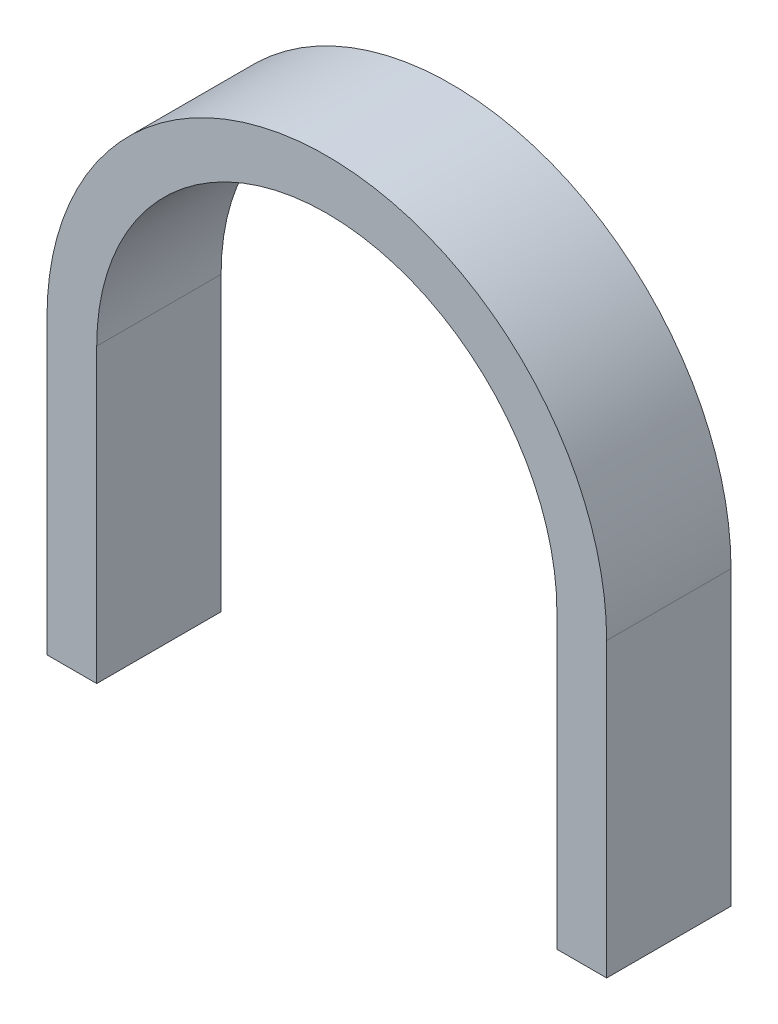
ISO-10303-21;
HEADER;
FILE_DESCRIPTION(('STEP AP214'),'2;1');
FILE_NAME('part.step','',(''),(''),'','','');
FILE_SCHEMA(('AUTOMOTIVE_DESIGN { 1 0 10303 214 1 1 1 1 }'));
ENDSEC;
DATA;
#1=APPLICATION_CONTEXT('core data for automotive mechanical design processes');
#2=APPLICATION_PROTOCOL_DEFINITION('international standard','automotive_design',2000,#1);
#3=PRODUCT_CONTEXT('',#1,'mechanical');
#4=PRODUCT('Part','Part','',(#3));
#5=PRODUCT_RELATED_PRODUCT_CATEGORY('part','',(#4));
#6=PRODUCT_DEFINITION_FORMATION('','',#4);
#7=PRODUCT_DEFINITION_CONTEXT('part definition',#1,'design');
#8=PRODUCT_DEFINITION('design','',#6,#7);
#9=PRODUCT_DEFINITION_SHAPE('','',#8);
#10=(LENGTH_UNIT() NAMED_UNIT(*) SI_UNIT(.MILLI.,.METRE.));
#11=(NAMED_UNIT(*) PLANE_ANGLE_UNIT() SI_UNIT($,.RADIAN.));
#12=(NAMED_UNIT(*) SI_UNIT($,.STERADIAN.) SOLID_ANGLE_UNIT());
#13=UNCERTAINTY_MEASURE_WITH_UNIT(LENGTH_MEASURE(1.E-05),#10,'distance_accuracy_value','');
#14=(GEOMETRIC_REPRESENTATION_CONTEXT(3) GLOBAL_UNCERTAINTY_ASSIGNED_CONTEXT((#13)) GLOBAL_UNIT_ASSIGNED_CONTEXT((#10,
#11,#12)) REPRESENTATION_CONTEXT('',''));
#15=CARTESIAN_POINT('',(0.,0.,0.));
#16=DIRECTION('',(0.,0.,1.));
#17=DIRECTION('',(1.,0.,0.));
#18=AXIS2_PLACEMENT_3D('',#15,#16,#17);
#19=CARTESIAN_POINT('',(0.,18.5,10.));
#20=DIRECTION('',(0.,0.,-1.));
#21=DIRECTION('',(-1.,0.,0.));
#22=AXIS2_PLACEMENT_3D('',#19,#20,#21);
#23=CYLINDRICAL_SURFACE('',#22,22.5);
#24=CARTESIAN_POINT('',(0.,18.5,0.));
#25=DIRECTION('',(0.,0.,1.));
#26=DIRECTION('',(1.,0.,0.));
#27=AXIS2_PLACEMENT_3D('',#24,#25,#26);
#28=CIRCLE('',#27,22.5);
#29=CARTESIAN_POINT('',(22.5,18.5,0.));
#30=VERTEX_POINT('',#29);
#31=CARTESIAN_POINT('',(-22.5,18.5,0.));
#32=VERTEX_POINT('',#31);
#33=EDGE_CURVE('E114',#30,#32,#28,.T.);
#34=ORIENTED_EDGE('',*,*,#33,.T.);
#35=DIRECTION('',(0.,0.,-1.));
#36=VECTOR('',#35,1.);
#37=CARTESIAN_POINT('',(-22.5,18.5,10.));
#38=LINE('',#37,#36);
#39=CARTESIAN_POINT('',(-22.5,18.5,10.));
#40=VERTEX_POINT('',#39);
#41=EDGE_CURVE('E11',#40,#32,#38,.T.);
#42=ORIENTED_EDGE('',*,*,#41,.F.);
#43=CARTESIAN_POINT('',(0.,18.5,10.));
#44=DIRECTION('',(0.,0.,1.));
#45=DIRECTION('',(1.,0.,0.));
#46=AXIS2_PLACEMENT_3D('',#43,#44,#45);
#47=CIRCLE('',#46,22.5);
#48=CARTESIAN_POINT('',(22.5,18.5,10.));
#49=VERTEX_POINT('',#48);
#50=EDGE_CURVE('E144',#49,#40,#47,.T.);
#51=ORIENTED_EDGE('',*,*,#50,.F.);
#52=DIRECTION('',(0.,0.,-1.));
#53=VECTOR('',#52,1.);
#54=CARTESIAN_POINT('',(22.5,18.5,10.));
#55=LINE('',#54,#53);
#56=EDGE_CURVE('E154',#49,#30,#55,.T.);
#57=ORIENTED_EDGE('',*,*,#56,.T.);
#58=EDGE_LOOP('',(#34,#42,#51,#57));
#59=FACE_BOUND('',#58,.T.);
#60=ADVANCED_FACE('F33',(#59),#23,.T.);
#61=CARTESIAN_POINT('',(-22.5,18.5,10.));
#62=DIRECTION('',(1.,0.,0.));
#63=DIRECTION('',(0.,0.,-1.));
#64=AXIS2_PLACEMENT_3D('',#61,#62,#63);
#65=PLANE('',#64);
#66=DIRECTION('',(0.,-1.,0.));
#67=VECTOR('',#66,1.);
#68=CARTESIAN_POINT('',(-22.5,18.5,0.));
#69=LINE('',#68,#67);
#70=CARTESIAN_POINT('',(-22.5,-5.,0.));
#71=VERTEX_POINT('',#70);
#72=EDGE_CURVE('E104',#32,#71,#69,.T.);
#73=ORIENTED_EDGE('',*,*,#72,.T.);
#74=DIRECTION('',(0.,0.,-1.));
#75=VECTOR('',#74,1.);
#76=CARTESIAN_POINT('',(-22.5,-5.,10.));
#77=LINE('',#76,#75);
#78=CARTESIAN_POINT('',(-22.5,-5.,10.));
#79=VERTEX_POINT('',#78);
#80=EDGE_CURVE('E108',#79,#71,#77,.T.);
#81=ORIENTED_EDGE('',*,*,#80,.F.);
#82=DIRECTION('',(0.,-1.,0.));
#83=VECTOR('',#82,1.);
#84=CARTESIAN_POINT('',(-22.5,18.5,10.));
#85=LINE('',#84,#83);
#86=EDGE_CURVE('E82',#40,#79,#85,.T.);
#87=ORIENTED_EDGE('',*,*,#86,.F.);
#88=ORIENTED_EDGE('',*,*,#41,.T.);
#89=EDGE_LOOP('',(#73,#81,#87,#88));
#90=FACE_BOUND('',#89,.T.);
#91=ADVANCED_FACE('F106',(#90),#65,.F.);
#92=CARTESIAN_POINT('',(-18.5,18.5,10.));
#93=DIRECTION('',(-1.,0.,0.));
#94=DIRECTION('',(0.,0.,1.));
#95=AXIS2_PLACEMENT_3D('',#92,#93,#94);
#96=PLANE('',#95);
#97=DIRECTION('',(0.,1.,0.));
#98=VECTOR('',#97,1.);
#99=CARTESIAN_POINT('',(-18.5,18.5,0.));
#100=LINE('',#99,#98);
#101=CARTESIAN_POINT('',(-18.5,-5.,0.));
#102=VERTEX_POINT('',#101);
#103=CARTESIAN_POINT('',(-18.5,18.5,0.));
#104=VERTEX_POINT('',#103);
#105=EDGE_CURVE('E113',#102,#104,#100,.T.);
#106=ORIENTED_EDGE('',*,*,#105,.T.);
#107=DIRECTION('',(0.,0.,-1.));
#108=VECTOR('',#107,1.);
#109=CARTESIAN_POINT('',(-18.5,18.5,10.));
#110=LINE('',#109,#108);
#111=CARTESIAN_POINT('',(-18.5,18.5,10.));
#112=VERTEX_POINT('',#111);
#113=EDGE_CURVE('E41',#112,#104,#110,.T.);
#114=ORIENTED_EDGE('',*,*,#113,.F.);
#115=DIRECTION('',(0.,1.,0.));
#116=VECTOR('',#115,1.);
#117=CARTESIAN_POINT('',(-18.5,18.5,10.));
#118=LINE('',#117,#116);
#119=CARTESIAN_POINT('',(-18.5,-5.,10.));
#120=VERTEX_POINT('',#119);
#121=EDGE_CURVE('E147',#120,#112,#118,.T.);
#122=ORIENTED_EDGE('',*,*,#121,.F.);
#123=DIRECTION('',(0.,0.,1.));
#124=VECTOR('',#123,1.);
#125=CARTESIAN_POINT('',(-18.5,-5.,0.));
#126=LINE('',#125,#124);
#127=EDGE_CURVE('E122',#102,#120,#126,.T.);
#128=ORIENTED_EDGE('',*,*,#127,.F.);
#129=EDGE_LOOP('',(#106,#114,#122,#128));
#130=FACE_BOUND('',#129,.T.);
#131=ADVANCED_FACE('F179',(#130),#96,.F.);
#132=CARTESIAN_POINT('',(0.,18.5,10.));
#133=DIRECTION('',(0.,0.,-1.));
#134=DIRECTION('',(-1.,0.,0.));
#135=AXIS2_PLACEMENT_3D('',#132,#133,#134);
#136=CYLINDRICAL_SURFACE('',#135,18.5);
#137=CARTESIAN_POINT('',(0.,18.5,0.));
#138=DIRECTION('',(0.,0.,-1.));
#139=DIRECTION('',(1.,0.,0.));
#140=AXIS2_PLACEMENT_3D('',#137,#138,#139);
#141=CIRCLE('',#140,18.5);
#142=CARTESIAN_POINT('',(18.5,18.5,0.));
#143=VERTEX_POINT('',#142);
#144=EDGE_CURVE('E68',#104,#143,#141,.T.);
#145=ORIENTED_EDGE('',*,*,#144,.T.);
#146=DIRECTION('',(0.,0.,-1.));
#147=VECTOR('',#146,1.);
#148=CARTESIAN_POINT('',(18.5,18.5,10.));
#149=LINE('',#148,#147);
#150=CARTESIAN_POINT('',(18.5,18.5,10.));
#151=VERTEX_POINT('',#150);
#152=EDGE_CURVE('E162',#151,#143,#149,.T.);
#153=ORIENTED_EDGE('',*,*,#152,.F.);
#154=CARTESIAN_POINT('',(0.,18.5,10.));
#155=DIRECTION('',(0.,0.,-1.));
#156=DIRECTION('',(1.,0.,0.));
#157=AXIS2_PLACEMENT_3D('',#154,#155,#156);
#158=CIRCLE('',#157,18.5);
#159=EDGE_CURVE('E149',#112,#151,#158,.T.);
#160=ORIENTED_EDGE('',*,*,#159,.F.);
#161=ORIENTED_EDGE('',*,*,#113,.T.);
#162=EDGE_LOOP('',(#145,#153,#160,#161));
#163=FACE_BOUND('',#162,.T.);
#164=ADVANCED_FACE('F165',(#163),#136,.F.);
#165=CARTESIAN_POINT('',(18.5,18.5,10.));
#166=DIRECTION('',(1.,0.,0.));
#167=DIRECTION('',(0.,0.,-1.));
#168=AXIS2_PLACEMENT_3D('',#165,#166,#167);
#169=PLANE('',#168);
#170=DIRECTION('',(0.,-1.,0.));
#171=VECTOR('',#170,1.);
#172=CARTESIAN_POINT('',(18.5,18.5,0.));
#173=LINE('',#172,#171);
#174=CARTESIAN_POINT('',(18.5,-5.,0.));
#175=VERTEX_POINT('',#174);
#176=EDGE_CURVE('E158',#143,#175,#173,.T.);
#177=ORIENTED_EDGE('',*,*,#176,.T.);
#178=DIRECTION('',(0.,0.,-1.));
#179=VECTOR('',#178,1.);
#180=CARTESIAN_POINT('',(18.5,-5.,10.));
#181=LINE('',#180,#179);
#182=CARTESIAN_POINT('',(18.5,-5.,10.));
#183=VERTEX_POINT('',#182);
#184=EDGE_CURVE('E132',#183,#175,#181,.T.);
#185=ORIENTED_EDGE('',*,*,#184,.F.);
#186=DIRECTION('',(0.,-1.,0.));
#187=VECTOR('',#186,1.);
#188=CARTESIAN_POINT('',(18.5,18.5,10.));
#189=LINE('',#188,#187);
#190=EDGE_CURVE('E151',#151,#183,#189,.T.);
#191=ORIENTED_EDGE('',*,*,#190,.F.);
#192=ORIENTED_EDGE('',*,*,#152,.T.);
#193=EDGE_LOOP('',(#177,#185,#191,#192));
#194=FACE_BOUND('',#193,.T.);
#195=ADVANCED_FACE('F171',(#194),#169,.F.);
#196=CARTESIAN_POINT('',(22.5,18.5,10.));
#197=DIRECTION('',(-1.,0.,0.));
#198=DIRECTION('',(0.,0.,1.));
#199=AXIS2_PLACEMENT_3D('',#196,#197,#198);
#200=PLANE('',#199);
#201=DIRECTION('',(0.,1.,0.));
#202=VECTOR('',#201,1.);
#203=CARTESIAN_POINT('',(22.5,18.5,0.));
#204=LINE('',#203,#202);
#205=CARTESIAN_POINT('',(22.5,-5.,0.));
#206=VERTEX_POINT('',#205);
#207=EDGE_CURVE('E75',#206,#30,#204,.T.);
#208=ORIENTED_EDGE('',*,*,#207,.T.);
#209=ORIENTED_EDGE('',*,*,#56,.F.);
#210=DIRECTION('',(0.,1.,0.));
#211=VECTOR('',#210,1.);
#212=CARTESIAN_POINT('',(22.5,18.5,10.));
#213=LINE('',#212,#211);
#214=CARTESIAN_POINT('',(22.5,-5.,10.));
#215=VERTEX_POINT('',#214);
#216=EDGE_CURVE('E49',#215,#49,#213,.T.);
#217=ORIENTED_EDGE('',*,*,#216,.F.);
#218=DIRECTION('',(0.,0.,1.));
#219=VECTOR('',#218,1.);
#220=CARTESIAN_POINT('',(22.5,-5.,0.));
#221=LINE('',#220,#219);
#222=EDGE_CURVE('E138',#206,#215,#221,.T.);
#223=ORIENTED_EDGE('',*,*,#222,.F.);
#224=EDGE_LOOP('',(#208,#209,#217,#223));
#225=FACE_BOUND('',#224,.T.);
#226=ADVANCED_FACE('F176',(#225),#200,.F.);
#227=CARTESIAN_POINT('',(0.,18.5,10.));
#228=DIRECTION('',(0.,0.,1.));
#229=DIRECTION('',(1.,0.,0.));
#230=AXIS2_PLACEMENT_3D('',#227,#228,#229);
#231=PLANE('',#230);
#232=ORIENTED_EDGE('',*,*,#50,.T.);
#233=ORIENTED_EDGE('',*,*,#86,.T.);
#234=DIRECTION('',(-1.,0.,0.));
#235=VECTOR('',#234,1.);
#236=CARTESIAN_POINT('',(-18.5,-5.,10.));
#237=LINE('',#236,#235);
#238=EDGE_CURVE('E127',#120,#79,#237,.T.);
#239=ORIENTED_EDGE('',*,*,#238,.F.);
#240=ORIENTED_EDGE('',*,*,#121,.T.);
#241=ORIENTED_EDGE('',*,*,#159,.T.);
#242=ORIENTED_EDGE('',*,*,#190,.T.);
#243=DIRECTION('',(-1.,0.,0.));
#244=VECTOR('',#243,1.);
#245=CARTESIAN_POINT('',(22.5,-5.,10.));
#246=LINE('',#245,#244);
#247=EDGE_CURVE('E141',#215,#183,#246,.T.);
#248=ORIENTED_EDGE('',*,*,#247,.F.);
#249=ORIENTED_EDGE('',*,*,#216,.T.);
#250=EDGE_LOOP('',(#232,#233,#239,#240,#241,#242,#248,#249));
#251=FACE_BOUND('',#250,.T.);
#252=ADVANCED_FACE('F173',(#251),#231,.T.);
#253=CARTESIAN_POINT('',(0.,18.5,0.));
#254=DIRECTION('',(0.,0.,1.));
#255=DIRECTION('',(1.,0.,0.));
#256=AXIS2_PLACEMENT_3D('',#253,#254,#255);
#257=PLANE('',#256);
#258=ORIENTED_EDGE('',*,*,#33,.F.);
#259=ORIENTED_EDGE('',*,*,#207,.F.);
#260=DIRECTION('',(1.,0.,0.));
#261=VECTOR('',#260,1.);
#262=CARTESIAN_POINT('',(18.5,-5.,0.));
#263=LINE('',#262,#261);
#264=EDGE_CURVE('E135',#175,#206,#263,.T.);
#265=ORIENTED_EDGE('',*,*,#264,.F.);
#266=ORIENTED_EDGE('',*,*,#176,.F.);
#267=ORIENTED_EDGE('',*,*,#144,.F.);
#268=ORIENTED_EDGE('',*,*,#105,.F.);
#269=DIRECTION('',(1.,0.,0.));
#270=VECTOR('',#269,1.);
#271=CARTESIAN_POINT('',(-22.5,-5.,0.));
#272=LINE('',#271,#270);
#273=EDGE_CURVE('E117',#71,#102,#272,.T.);
#274=ORIENTED_EDGE('',*,*,#273,.F.);
#275=ORIENTED_EDGE('',*,*,#72,.F.);
#276=EDGE_LOOP('',(#258,#259,#265,#266,#267,#268,#274,#275));
#277=FACE_BOUND('',#276,.T.);
#278=ADVANCED_FACE('F118',(#277),#257,.F.);
#279=CARTESIAN_POINT('',(0.,-5.,0.));
#280=DIRECTION('',(0.,-1.,0.));
#281=DIRECTION('',(0.,0.,-1.));
#282=AXIS2_PLACEMENT_3D('',#279,#280,#281);
#283=PLANE('',#282);
#284=ORIENTED_EDGE('',*,*,#184,.T.);
#285=ORIENTED_EDGE('',*,*,#264,.T.);
#286=ORIENTED_EDGE('',*,*,#222,.T.);
#287=ORIENTED_EDGE('',*,*,#247,.T.);
#288=EDGE_LOOP('',(#284,#285,#286,#287));
#289=FACE_BOUND('',#288,.T.);
#290=ADVANCED_FACE('F175',(#289),#283,.T.);
#291=CARTESIAN_POINT('',(0.,-5.,0.));
#292=DIRECTION('',(0.,-1.,0.));
#293=DIRECTION('',(0.,0.,-1.));
#294=AXIS2_PLACEMENT_3D('',#291,#292,#293);
#295=PLANE('',#294);
#296=ORIENTED_EDGE('',*,*,#80,.T.);
#297=ORIENTED_EDGE('',*,*,#273,.T.);
#298=ORIENTED_EDGE('',*,*,#127,.T.);
#299=ORIENTED_EDGE('',*,*,#238,.T.);
#300=EDGE_LOOP('',(#296,#297,#298,#299));
#301=FACE_BOUND('',#300,.T.);
#302=ADVANCED_FACE('F125',(#301),#295,.T.);
#303=CLOSED_SHELL('',(#60,#91,#131,#164,#195,#226,#252,#278,#290,#302));
#304=MANIFOLD_SOLID_BREP('B2',#303);
#305=ADVANCED_BREP_SHAPE_REPRESENTATION('',(#18,#304),#14);
#306=SHAPE_DEFINITION_REPRESENTATION(#9,#305);
ENDSEC;
END-ISO-10303-21;
